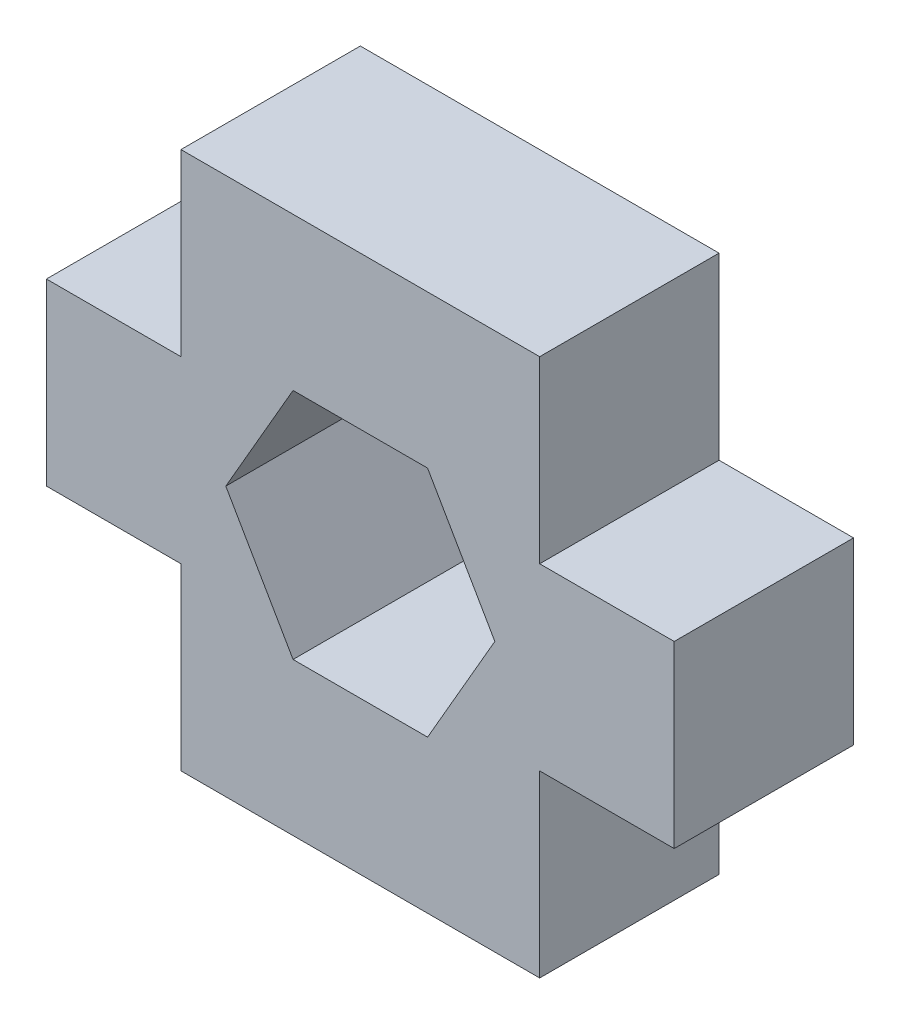
ISO-10303-21;
HEADER;
FILE_DESCRIPTION(('STEP AP214'),'2;1');
FILE_NAME('part.step','',(''),(''),'','','');
FILE_SCHEMA(('AUTOMOTIVE_DESIGN { 1 0 10303 214 1 1 1 1 }'));
ENDSEC;
DATA;
#1=APPLICATION_CONTEXT('core data for automotive mechanical design processes');
#2=APPLICATION_PROTOCOL_DEFINITION('international standard','automotive_design',2000,#1);
#3=PRODUCT_CONTEXT('',#1,'mechanical');
#4=PRODUCT('Part','Part','',(#3));
#5=PRODUCT_RELATED_PRODUCT_CATEGORY('part','',(#4));
#6=PRODUCT_DEFINITION_FORMATION('','',#4);
#7=PRODUCT_DEFINITION_CONTEXT('part definition',#1,'design');
#8=PRODUCT_DEFINITION('design','',#6,#7);
#9=PRODUCT_DEFINITION_SHAPE('','',#8);
#10=(LENGTH_UNIT() NAMED_UNIT(*) SI_UNIT(.MILLI.,.METRE.));
#11=(NAMED_UNIT(*) PLANE_ANGLE_UNIT() SI_UNIT($,.RADIAN.));
#12=(NAMED_UNIT(*) SI_UNIT($,.STERADIAN.) SOLID_ANGLE_UNIT());
#13=UNCERTAINTY_MEASURE_WITH_UNIT(LENGTH_MEASURE(1.E-05),#10,'distance_accuracy_value','');
#14=(GEOMETRIC_REPRESENTATION_CONTEXT(3) GLOBAL_UNCERTAINTY_ASSIGNED_CONTEXT((#13)) GLOBAL_UNIT_ASSIGNED_CONTEXT((#10,
#11,#12)) REPRESENTATION_CONTEXT('',''));
#15=CARTESIAN_POINT('',(0.,0.,0.));
#16=DIRECTION('',(0.,0.,1.));
#17=DIRECTION('',(1.,0.,0.));
#18=AXIS2_PLACEMENT_3D('',#15,#16,#17);
#19=CARTESIAN_POINT('',(0.,0.,4.));
#20=DIRECTION('',(0.,0.,1.));
#21=DIRECTION('',(1.,0.,0.));
#22=AXIS2_PLACEMENT_3D('',#19,#20,#21);
#23=PLANE('',#22);
#24=DIRECTION('',(0.,-1.,0.));
#25=VECTOR('',#24,1.);
#26=CARTESIAN_POINT('',(0.,4.,4.));
#27=LINE('',#26,#25);
#28=CARTESIAN_POINT('',(0.,4.,4.));
#29=VERTEX_POINT('',#28);
#30=CARTESIAN_POINT('',(0.,0.,4.));
#31=VERTEX_POINT('',#30);
#32=EDGE_CURVE('E211',#29,#31,#27,.T.);
#33=ORIENTED_EDGE('',*,*,#32,.T.);
#34=DIRECTION('',(1.,0.,0.));
#35=VECTOR('',#34,1.);
#36=CARTESIAN_POINT('',(0.,0.,4.));
#37=LINE('',#36,#35);
#38=CARTESIAN_POINT('',(8.,0.,4.));
#39=VERTEX_POINT('',#38);
#40=EDGE_CURVE('E214',#31,#39,#37,.T.);
#41=ORIENTED_EDGE('',*,*,#40,.T.);
#42=DIRECTION('',(0.,1.,0.));
#43=VECTOR('',#42,1.);
#44=CARTESIAN_POINT('',(8.,0.,4.));
#45=LINE('',#44,#43);
#46=CARTESIAN_POINT('',(8.,4.,4.));
#47=VERTEX_POINT('',#46);
#48=EDGE_CURVE('E217',#39,#47,#45,.T.);
#49=ORIENTED_EDGE('',*,*,#48,.T.);
#50=DIRECTION('',(1.,0.,0.));
#51=VECTOR('',#50,1.);
#52=CARTESIAN_POINT('',(8.,4.,4.));
#53=LINE('',#52,#51);
#54=CARTESIAN_POINT('',(11.,4.,4.));
#55=VERTEX_POINT('',#54);
#56=EDGE_CURVE('E219',#47,#55,#53,.T.);
#57=ORIENTED_EDGE('',*,*,#56,.T.);
#58=DIRECTION('',(0.,1.,0.));
#59=VECTOR('',#58,1.);
#60=CARTESIAN_POINT('',(11.,4.,4.));
#61=LINE('',#60,#59);
#62=CARTESIAN_POINT('',(11.,8.,4.));
#63=VERTEX_POINT('',#62);
#64=EDGE_CURVE('E221',#55,#63,#61,.T.);
#65=ORIENTED_EDGE('',*,*,#64,.T.);
#66=DIRECTION('',(-1.,0.,0.));
#67=VECTOR('',#66,1.);
#68=CARTESIAN_POINT('',(8.,8.,4.));
#69=LINE('',#68,#67);
#70=CARTESIAN_POINT('',(8.,8.,4.));
#71=VERTEX_POINT('',#70);
#72=EDGE_CURVE('E223',#63,#71,#69,.T.);
#73=ORIENTED_EDGE('',*,*,#72,.T.);
#74=DIRECTION('',(0.,1.,0.));
#75=VECTOR('',#74,1.);
#76=CARTESIAN_POINT('',(8.,8.,4.));
#77=LINE('',#76,#75);
#78=CARTESIAN_POINT('',(8.,12.,4.));
#79=VERTEX_POINT('',#78);
#80=EDGE_CURVE('E225',#71,#79,#77,.T.);
#81=ORIENTED_EDGE('',*,*,#80,.T.);
#82=DIRECTION('',(-1.,0.,0.));
#83=VECTOR('',#82,1.);
#84=CARTESIAN_POINT('',(8.,12.,4.));
#85=LINE('',#84,#83);
#86=CARTESIAN_POINT('',(0.,12.,4.));
#87=VERTEX_POINT('',#86);
#88=EDGE_CURVE('E227',#79,#87,#85,.T.);
#89=ORIENTED_EDGE('',*,*,#88,.T.);
#90=DIRECTION('',(0.,-1.,0.));
#91=VECTOR('',#90,1.);
#92=CARTESIAN_POINT('',(0.,12.,4.));
#93=LINE('',#92,#91);
#94=CARTESIAN_POINT('',(0.,8.,4.));
#95=VERTEX_POINT('',#94);
#96=EDGE_CURVE('E229',#87,#95,#93,.T.);
#97=ORIENTED_EDGE('',*,*,#96,.T.);
#98=DIRECTION('',(-1.,0.,0.));
#99=VECTOR('',#98,1.);
#100=CARTESIAN_POINT('',(0.,8.,4.));
#101=LINE('',#100,#99);
#102=CARTESIAN_POINT('',(-3.,8.,4.));
#103=VERTEX_POINT('',#102);
#104=EDGE_CURVE('E231',#95,#103,#101,.T.);
#105=ORIENTED_EDGE('',*,*,#104,.T.);
#106=DIRECTION('',(0.,-1.,0.));
#107=VECTOR('',#106,1.);
#108=CARTESIAN_POINT('',(-3.,8.,4.));
#109=LINE('',#108,#107);
#110=CARTESIAN_POINT('',(-3.,4.,4.));
#111=VERTEX_POINT('',#110);
#112=EDGE_CURVE('E233',#103,#111,#109,.T.);
#113=ORIENTED_EDGE('',*,*,#112,.T.);
#114=DIRECTION('',(1.,0.,0.));
#115=VECTOR('',#114,1.);
#116=CARTESIAN_POINT('',(-3.,4.,4.));
#117=LINE('',#116,#115);
#118=EDGE_CURVE('E235',#111,#29,#117,.T.);
#119=ORIENTED_EDGE('',*,*,#118,.T.);
#120=EDGE_LOOP('',(#33,#41,#49,#57,#65,#73,#81,#89,#97,#105,#113,#119));
#121=FACE_BOUND('',#120,.T.);
#122=DIRECTION('',(-0.5,0.866025403784439,0.));
#123=VECTOR('',#122,1.);
#124=CARTESIAN_POINT('',(7.00000000000003,5.99999999999998,4.));
#125=LINE('',#124,#123);
#126=CARTESIAN_POINT('',(7.00000000000003,5.99999999999998,4.));
#127=VERTEX_POINT('',#126);
#128=CARTESIAN_POINT('',(5.50000000000002,8.59807621135331,4.));
#129=VERTEX_POINT('',#128);
#130=EDGE_CURVE('E168',#127,#129,#125,.T.);
#131=ORIENTED_EDGE('',*,*,#130,.F.);
#132=DIRECTION('',(0.5,0.866025403784439,0.));
#133=VECTOR('',#132,1.);
#134=CARTESIAN_POINT('',(5.50000000000002,3.40192378864665,4.));
#135=LINE('',#134,#133);
#136=CARTESIAN_POINT('',(5.50000000000002,3.40192378864665,4.));
#137=VERTEX_POINT('',#136);
#138=EDGE_CURVE('E160',#137,#127,#135,.T.);
#139=ORIENTED_EDGE('',*,*,#138,.F.);
#140=DIRECTION('',(1.,0.,0.));
#141=VECTOR('',#140,1.);
#142=CARTESIAN_POINT('',(2.50000000000001,3.40192378864666,4.));
#143=LINE('',#142,#141);
#144=CARTESIAN_POINT('',(2.50000000000001,3.40192378864666,4.));
#145=VERTEX_POINT('',#144);
#146=EDGE_CURVE('E189',#145,#137,#143,.T.);
#147=ORIENTED_EDGE('',*,*,#146,.F.);
#148=DIRECTION('',(0.5,-0.866025403784438,0.));
#149=VECTOR('',#148,1.);
#150=CARTESIAN_POINT('',(1.,5.99999999999998,4.));
#151=LINE('',#150,#149);
#152=CARTESIAN_POINT('',(1.,5.99999999999998,4.));
#153=VERTEX_POINT('',#152);
#154=EDGE_CURVE('E187',#153,#145,#151,.T.);
#155=ORIENTED_EDGE('',*,*,#154,.F.);
#156=DIRECTION('',(-0.5,-0.866025403784439,0.));
#157=VECTOR('',#156,1.);
#158=CARTESIAN_POINT('',(2.50000000000001,8.59807621135331,4.));
#159=LINE('',#158,#157);
#160=CARTESIAN_POINT('',(2.50000000000001,8.59807621135331,4.));
#161=VERTEX_POINT('',#160);
#162=EDGE_CURVE('E183',#161,#153,#159,.T.);
#163=ORIENTED_EDGE('',*,*,#162,.F.);
#164=DIRECTION('',(-1.,0.,0.));
#165=VECTOR('',#164,1.);
#166=CARTESIAN_POINT('',(5.50000000000002,8.59807621135331,4.));
#167=LINE('',#166,#165);
#168=EDGE_CURVE('E181',#129,#161,#167,.T.);
#169=ORIENTED_EDGE('',*,*,#168,.F.);
#170=EDGE_LOOP('',(#131,#139,#147,#155,#163,#169));
#171=FACE_BOUND('',#170,.T.);
#172=ADVANCED_FACE('F35',(#121,#171),#23,.T.);
#173=CARTESIAN_POINT('',(0.,0.,0.));
#174=DIRECTION('',(0.,0.,1.));
#175=DIRECTION('',(1.,0.,0.));
#176=AXIS2_PLACEMENT_3D('',#173,#174,#175);
#177=PLANE('',#176);
#178=DIRECTION('',(0.,-1.,0.));
#179=VECTOR('',#178,1.);
#180=CARTESIAN_POINT('',(0.,4.,0.));
#181=LINE('',#180,#179);
#182=CARTESIAN_POINT('',(0.,4.,0.));
#183=VERTEX_POINT('',#182);
#184=CARTESIAN_POINT('',(0.,0.,0.));
#185=VERTEX_POINT('',#184);
#186=EDGE_CURVE('E176',#183,#185,#181,.T.);
#187=ORIENTED_EDGE('',*,*,#186,.F.);
#188=DIRECTION('',(1.,0.,0.));
#189=VECTOR('',#188,1.);
#190=CARTESIAN_POINT('',(-3.,4.,0.));
#191=LINE('',#190,#189);
#192=CARTESIAN_POINT('',(-3.,4.,0.));
#193=VERTEX_POINT('',#192);
#194=EDGE_CURVE('E215',#193,#183,#191,.T.);
#195=ORIENTED_EDGE('',*,*,#194,.F.);
#196=DIRECTION('',(0.,-1.,0.));
#197=VECTOR('',#196,1.);
#198=CARTESIAN_POINT('',(-3.,8.,0.));
#199=LINE('',#198,#197);
#200=CARTESIAN_POINT('',(-3.,8.,0.));
#201=VERTEX_POINT('',#200);
#202=EDGE_CURVE('E258',#201,#193,#199,.T.);
#203=ORIENTED_EDGE('',*,*,#202,.F.);
#204=DIRECTION('',(-1.,0.,0.));
#205=VECTOR('',#204,1.);
#206=CARTESIAN_POINT('',(0.,8.,0.));
#207=LINE('',#206,#205);
#208=CARTESIAN_POINT('',(0.,8.,0.));
#209=VERTEX_POINT('',#208);
#210=EDGE_CURVE('E256',#209,#201,#207,.T.);
#211=ORIENTED_EDGE('',*,*,#210,.F.);
#212=DIRECTION('',(0.,-1.,0.));
#213=VECTOR('',#212,1.);
#214=CARTESIAN_POINT('',(0.,12.,0.));
#215=LINE('',#214,#213);
#216=CARTESIAN_POINT('',(0.,12.,0.));
#217=VERTEX_POINT('',#216);
#218=EDGE_CURVE('E254',#217,#209,#215,.T.);
#219=ORIENTED_EDGE('',*,*,#218,.F.);
#220=DIRECTION('',(-1.,0.,0.));
#221=VECTOR('',#220,1.);
#222=CARTESIAN_POINT('',(8.,12.,0.));
#223=LINE('',#222,#221);
#224=CARTESIAN_POINT('',(8.,12.,0.));
#225=VERTEX_POINT('',#224);
#226=EDGE_CURVE('E252',#225,#217,#223,.T.);
#227=ORIENTED_EDGE('',*,*,#226,.F.);
#228=DIRECTION('',(0.,1.,0.));
#229=VECTOR('',#228,1.);
#230=CARTESIAN_POINT('',(8.,8.,0.));
#231=LINE('',#230,#229);
#232=CARTESIAN_POINT('',(8.,8.,0.));
#233=VERTEX_POINT('',#232);
#234=EDGE_CURVE('E250',#233,#225,#231,.T.);
#235=ORIENTED_EDGE('',*,*,#234,.F.);
#236=DIRECTION('',(-1.,0.,0.));
#237=VECTOR('',#236,1.);
#238=CARTESIAN_POINT('',(8.,8.,0.));
#239=LINE('',#238,#237);
#240=CARTESIAN_POINT('',(11.,8.,0.));
#241=VERTEX_POINT('',#240);
#242=EDGE_CURVE('E248',#241,#233,#239,.T.);
#243=ORIENTED_EDGE('',*,*,#242,.F.);
#244=DIRECTION('',(0.,1.,0.));
#245=VECTOR('',#244,1.);
#246=CARTESIAN_POINT('',(11.,4.,0.));
#247=LINE('',#246,#245);
#248=CARTESIAN_POINT('',(11.,4.,0.));
#249=VERTEX_POINT('',#248);
#250=EDGE_CURVE('E246',#249,#241,#247,.T.);
#251=ORIENTED_EDGE('',*,*,#250,.F.);
#252=DIRECTION('',(1.,0.,0.));
#253=VECTOR('',#252,1.);
#254=CARTESIAN_POINT('',(8.,4.,0.));
#255=LINE('',#254,#253);
#256=CARTESIAN_POINT('',(8.,4.,0.));
#257=VERTEX_POINT('',#256);
#258=EDGE_CURVE('E244',#257,#249,#255,.T.);
#259=ORIENTED_EDGE('',*,*,#258,.F.);
#260=DIRECTION('',(0.,1.,0.));
#261=VECTOR('',#260,1.);
#262=CARTESIAN_POINT('',(8.,0.,0.));
#263=LINE('',#262,#261);
#264=CARTESIAN_POINT('',(8.,0.,0.));
#265=VERTEX_POINT('',#264);
#266=EDGE_CURVE('E242',#265,#257,#263,.T.);
#267=ORIENTED_EDGE('',*,*,#266,.F.);
#268=DIRECTION('',(1.,0.,0.));
#269=VECTOR('',#268,1.);
#270=CARTESIAN_POINT('',(0.,0.,0.));
#271=LINE('',#270,#269);
#272=EDGE_CURVE('E240',#185,#265,#271,.T.);
#273=ORIENTED_EDGE('',*,*,#272,.F.);
#274=EDGE_LOOP('',(#187,#195,#203,#211,#219,#227,#235,#243,#251,#259,#267,#273));
#275=FACE_BOUND('',#274,.T.);
#276=DIRECTION('',(0.5,0.866025403784439,0.));
#277=VECTOR('',#276,1.);
#278=CARTESIAN_POINT('',(5.50000000000002,3.40192378864665,0.));
#279=LINE('',#278,#277);
#280=CARTESIAN_POINT('',(5.50000000000002,3.40192378864665,0.));
#281=VERTEX_POINT('',#280);
#282=CARTESIAN_POINT('',(7.00000000000003,5.99999999999998,0.));
#283=VERTEX_POINT('',#282);
#284=EDGE_CURVE('E58',#281,#283,#279,.T.);
#285=ORIENTED_EDGE('',*,*,#284,.T.);
#286=DIRECTION('',(-0.5,0.866025403784439,0.));
#287=VECTOR('',#286,1.);
#288=CARTESIAN_POINT('',(7.00000000000003,5.99999999999998,0.));
#289=LINE('',#288,#287);
#290=CARTESIAN_POINT('',(5.50000000000002,8.59807621135331,0.));
#291=VERTEX_POINT('',#290);
#292=EDGE_CURVE('E175',#283,#291,#289,.T.);
#293=ORIENTED_EDGE('',*,*,#292,.T.);
#294=DIRECTION('',(-1.,0.,0.));
#295=VECTOR('',#294,1.);
#296=CARTESIAN_POINT('',(5.50000000000002,8.59807621135331,0.));
#297=LINE('',#296,#295);
#298=CARTESIAN_POINT('',(2.50000000000001,8.59807621135331,0.));
#299=VERTEX_POINT('',#298);
#300=EDGE_CURVE('E193',#291,#299,#297,.T.);
#301=ORIENTED_EDGE('',*,*,#300,.T.);
#302=DIRECTION('',(-0.5,-0.866025403784439,0.));
#303=VECTOR('',#302,1.);
#304=CARTESIAN_POINT('',(2.50000000000001,8.59807621135331,0.));
#305=LINE('',#304,#303);
#306=CARTESIAN_POINT('',(1.,5.99999999999998,0.));
#307=VERTEX_POINT('',#306);
#308=EDGE_CURVE('E196',#299,#307,#305,.T.);
#309=ORIENTED_EDGE('',*,*,#308,.T.);
#310=DIRECTION('',(0.5,-0.866025403784438,0.));
#311=VECTOR('',#310,1.);
#312=CARTESIAN_POINT('',(1.,5.99999999999998,0.));
#313=LINE('',#312,#311);
#314=CARTESIAN_POINT('',(2.50000000000001,3.40192378864666,0.));
#315=VERTEX_POINT('',#314);
#316=EDGE_CURVE('E199',#307,#315,#313,.T.);
#317=ORIENTED_EDGE('',*,*,#316,.T.);
#318=DIRECTION('',(1.,0.,0.));
#319=VECTOR('',#318,1.);
#320=CARTESIAN_POINT('',(2.50000000000001,3.40192378864666,0.));
#321=LINE('',#320,#319);
#322=EDGE_CURVE('E169',#315,#281,#321,.T.);
#323=ORIENTED_EDGE('',*,*,#322,.T.);
#324=EDGE_LOOP('',(#285,#293,#301,#309,#317,#323));
#325=FACE_BOUND('',#324,.T.);
#326=ADVANCED_FACE('F300',(#275,#325),#177,.F.);
#327=CARTESIAN_POINT('',(0.,4.,4.));
#328=DIRECTION('',(1.,0.,0.));
#329=DIRECTION('',(0.,0.,-1.));
#330=AXIS2_PLACEMENT_3D('',#327,#328,#329);
#331=PLANE('',#330);
#332=ORIENTED_EDGE('',*,*,#186,.T.);
#333=DIRECTION('',(0.,0.,-1.));
#334=VECTOR('',#333,1.);
#335=CARTESIAN_POINT('',(0.,0.,4.));
#336=LINE('',#335,#334);
#337=EDGE_CURVE('E11',#31,#185,#336,.T.);
#338=ORIENTED_EDGE('',*,*,#337,.F.);
#339=ORIENTED_EDGE('',*,*,#32,.F.);
#340=DIRECTION('',(0.,0.,-1.));
#341=VECTOR('',#340,1.);
#342=CARTESIAN_POINT('',(0.,4.,4.));
#343=LINE('',#342,#341);
#344=EDGE_CURVE('E237',#29,#183,#343,.T.);
#345=ORIENTED_EDGE('',*,*,#344,.T.);
#346=EDGE_LOOP('',(#332,#338,#339,#345));
#347=FACE_BOUND('',#346,.T.);
#348=ADVANCED_FACE('F37',(#347),#331,.F.);
#349=CARTESIAN_POINT('',(0.,0.,4.));
#350=DIRECTION('',(0.,1.,0.));
#351=DIRECTION('',(0.,0.,1.));
#352=AXIS2_PLACEMENT_3D('',#349,#350,#351);
#353=PLANE('',#352);
#354=ORIENTED_EDGE('',*,*,#272,.T.);
#355=DIRECTION('',(0.,0.,-1.));
#356=VECTOR('',#355,1.);
#357=CARTESIAN_POINT('',(8.,0.,4.));
#358=LINE('',#357,#356);
#359=EDGE_CURVE('E43',#39,#265,#358,.T.);
#360=ORIENTED_EDGE('',*,*,#359,.F.);
#361=ORIENTED_EDGE('',*,*,#40,.F.);
#362=ORIENTED_EDGE('',*,*,#337,.T.);
#363=EDGE_LOOP('',(#354,#360,#361,#362));
#364=FACE_BOUND('',#363,.T.);
#365=ADVANCED_FACE('F317',(#364),#353,.F.);
#366=CARTESIAN_POINT('',(8.,0.,4.));
#367=DIRECTION('',(-1.,0.,0.));
#368=DIRECTION('',(0.,0.,1.));
#369=AXIS2_PLACEMENT_3D('',#366,#367,#368);
#370=PLANE('',#369);
#371=ORIENTED_EDGE('',*,*,#266,.T.);
#372=DIRECTION('',(0.,0.,-1.));
#373=VECTOR('',#372,1.);
#374=CARTESIAN_POINT('',(8.,4.,4.));
#375=LINE('',#374,#373);
#376=EDGE_CURVE('E287',#47,#257,#375,.T.);
#377=ORIENTED_EDGE('',*,*,#376,.F.);
#378=ORIENTED_EDGE('',*,*,#48,.F.);
#379=ORIENTED_EDGE('',*,*,#359,.T.);
#380=EDGE_LOOP('',(#371,#377,#378,#379));
#381=FACE_BOUND('',#380,.T.);
#382=ADVANCED_FACE('F294',(#381),#370,.F.);
#383=CARTESIAN_POINT('',(8.,4.,4.));
#384=DIRECTION('',(0.,1.,0.));
#385=DIRECTION('',(-1.,0.,0.));
#386=AXIS2_PLACEMENT_3D('',#383,#384,#385);
#387=PLANE('',#386);
#388=ORIENTED_EDGE('',*,*,#258,.T.);
#389=DIRECTION('',(0.,0.,-1.));
#390=VECTOR('',#389,1.);
#391=CARTESIAN_POINT('',(11.,4.,4.));
#392=LINE('',#391,#390);
#393=EDGE_CURVE('E284',#55,#249,#392,.T.);
#394=ORIENTED_EDGE('',*,*,#393,.F.);
#395=ORIENTED_EDGE('',*,*,#56,.F.);
#396=ORIENTED_EDGE('',*,*,#376,.T.);
#397=EDGE_LOOP('',(#388,#394,#395,#396));
#398=FACE_BOUND('',#397,.T.);
#399=ADVANCED_FACE('F306',(#398),#387,.F.);
#400=CARTESIAN_POINT('',(11.,4.,4.));
#401=DIRECTION('',(-1.,0.,0.));
#402=DIRECTION('',(0.,0.,1.));
#403=AXIS2_PLACEMENT_3D('',#400,#401,#402);
#404=PLANE('',#403);
#405=ORIENTED_EDGE('',*,*,#250,.T.);
#406=DIRECTION('',(0.,0.,-1.));
#407=VECTOR('',#406,1.);
#408=CARTESIAN_POINT('',(11.,8.,4.));
#409=LINE('',#408,#407);
#410=EDGE_CURVE('E281',#63,#241,#409,.T.);
#411=ORIENTED_EDGE('',*,*,#410,.F.);
#412=ORIENTED_EDGE('',*,*,#64,.F.);
#413=ORIENTED_EDGE('',*,*,#393,.T.);
#414=EDGE_LOOP('',(#405,#411,#412,#413));
#415=FACE_BOUND('',#414,.T.);
#416=ADVANCED_FACE('F310',(#415),#404,.F.);
#417=CARTESIAN_POINT('',(8.,8.,4.));
#418=DIRECTION('',(0.,-1.,0.));
#419=DIRECTION('',(0.,0.,-1.));
#420=AXIS2_PLACEMENT_3D('',#417,#418,#419);
#421=PLANE('',#420);
#422=ORIENTED_EDGE('',*,*,#242,.T.);
#423=DIRECTION('',(0.,0.,-1.));
#424=VECTOR('',#423,1.);
#425=CARTESIAN_POINT('',(8.,8.,4.));
#426=LINE('',#425,#424);
#427=EDGE_CURVE('E278',#71,#233,#426,.T.);
#428=ORIENTED_EDGE('',*,*,#427,.F.);
#429=ORIENTED_EDGE('',*,*,#72,.F.);
#430=ORIENTED_EDGE('',*,*,#410,.T.);
#431=EDGE_LOOP('',(#422,#428,#429,#430));
#432=FACE_BOUND('',#431,.T.);
#433=ADVANCED_FACE('F350',(#432),#421,.F.);
#434=CARTESIAN_POINT('',(8.,8.,4.));
#435=DIRECTION('',(-1.,0.,0.));
#436=DIRECTION('',(0.,0.,1.));
#437=AXIS2_PLACEMENT_3D('',#434,#435,#436);
#438=PLANE('',#437);
#439=ORIENTED_EDGE('',*,*,#234,.T.);
#440=DIRECTION('',(0.,0.,-1.));
#441=VECTOR('',#440,1.);
#442=CARTESIAN_POINT('',(8.,12.,4.));
#443=LINE('',#442,#441);
#444=EDGE_CURVE('E275',#79,#225,#443,.T.);
#445=ORIENTED_EDGE('',*,*,#444,.F.);
#446=ORIENTED_EDGE('',*,*,#80,.F.);
#447=ORIENTED_EDGE('',*,*,#427,.T.);
#448=EDGE_LOOP('',(#439,#445,#446,#447));
#449=FACE_BOUND('',#448,.T.);
#450=ADVANCED_FACE('F348',(#449),#438,.F.);
#451=CARTESIAN_POINT('',(8.,12.,4.));
#452=DIRECTION('',(0.,-1.,0.));
#453=DIRECTION('',(0.,0.,-1.));
#454=AXIS2_PLACEMENT_3D('',#451,#452,#453);
#455=PLANE('',#454);
#456=ORIENTED_EDGE('',*,*,#226,.T.);
#457=DIRECTION('',(0.,0.,-1.));
#458=VECTOR('',#457,1.);
#459=CARTESIAN_POINT('',(0.,12.,4.));
#460=LINE('',#459,#458);
#461=EDGE_CURVE('E272',#87,#217,#460,.T.);
#462=ORIENTED_EDGE('',*,*,#461,.F.);
#463=ORIENTED_EDGE('',*,*,#88,.F.);
#464=ORIENTED_EDGE('',*,*,#444,.T.);
#465=EDGE_LOOP('',(#456,#462,#463,#464));
#466=FACE_BOUND('',#465,.T.);
#467=ADVANCED_FACE('F344',(#466),#455,.F.);
#468=CARTESIAN_POINT('',(0.,12.,4.));
#469=DIRECTION('',(1.,0.,0.));
#470=DIRECTION('',(0.,0.,-1.));
#471=AXIS2_PLACEMENT_3D('',#468,#469,#470);
#472=PLANE('',#471);
#473=ORIENTED_EDGE('',*,*,#218,.T.);
#474=DIRECTION('',(0.,0.,-1.));
#475=VECTOR('',#474,1.);
#476=CARTESIAN_POINT('',(0.,8.,4.));
#477=LINE('',#476,#475);
#478=EDGE_CURVE('E269',#95,#209,#477,.T.);
#479=ORIENTED_EDGE('',*,*,#478,.F.);
#480=ORIENTED_EDGE('',*,*,#96,.F.);
#481=ORIENTED_EDGE('',*,*,#461,.T.);
#482=EDGE_LOOP('',(#473,#479,#480,#481));
#483=FACE_BOUND('',#482,.T.);
#484=ADVANCED_FACE('F339',(#483),#472,.F.);
#485=CARTESIAN_POINT('',(0.,8.,4.));
#486=DIRECTION('',(0.,-1.,0.));
#487=DIRECTION('',(0.,0.,-1.));
#488=AXIS2_PLACEMENT_3D('',#485,#486,#487);
#489=PLANE('',#488);
#490=ORIENTED_EDGE('',*,*,#210,.T.);
#491=DIRECTION('',(0.,0.,-1.));
#492=VECTOR('',#491,1.);
#493=CARTESIAN_POINT('',(-3.,8.,4.));
#494=LINE('',#493,#492);
#495=EDGE_CURVE('E266',#103,#201,#494,.T.);
#496=ORIENTED_EDGE('',*,*,#495,.F.);
#497=ORIENTED_EDGE('',*,*,#104,.F.);
#498=ORIENTED_EDGE('',*,*,#478,.T.);
#499=EDGE_LOOP('',(#490,#496,#497,#498));
#500=FACE_BOUND('',#499,.T.);
#501=ADVANCED_FACE('F333',(#500),#489,.F.);
#502=CARTESIAN_POINT('',(-3.,8.,4.));
#503=DIRECTION('',(1.,0.,0.));
#504=DIRECTION('',(0.,0.,-1.));
#505=AXIS2_PLACEMENT_3D('',#502,#503,#504);
#506=PLANE('',#505);
#507=ORIENTED_EDGE('',*,*,#202,.T.);
#508=DIRECTION('',(0.,0.,-1.));
#509=VECTOR('',#508,1.);
#510=CARTESIAN_POINT('',(-3.,4.,4.));
#511=LINE('',#510,#509);
#512=EDGE_CURVE('E263',#111,#193,#511,.T.);
#513=ORIENTED_EDGE('',*,*,#512,.F.);
#514=ORIENTED_EDGE('',*,*,#112,.F.);
#515=ORIENTED_EDGE('',*,*,#495,.T.);
#516=EDGE_LOOP('',(#507,#513,#514,#515));
#517=FACE_BOUND('',#516,.T.);
#518=ADVANCED_FACE('F329',(#517),#506,.F.);
#519=CARTESIAN_POINT('',(-3.,4.,4.));
#520=DIRECTION('',(0.,1.,0.));
#521=DIRECTION('',(0.,0.,1.));
#522=AXIS2_PLACEMENT_3D('',#519,#520,#521);
#523=PLANE('',#522);
#524=ORIENTED_EDGE('',*,*,#194,.T.);
#525=ORIENTED_EDGE('',*,*,#344,.F.);
#526=ORIENTED_EDGE('',*,*,#118,.F.);
#527=ORIENTED_EDGE('',*,*,#512,.T.);
#528=EDGE_LOOP('',(#524,#525,#526,#527));
#529=FACE_BOUND('',#528,.T.);
#530=ADVANCED_FACE('F324',(#529),#523,.F.);
#531=CARTESIAN_POINT('',(5.50000000000002,3.40192378864665,4.));
#532=DIRECTION('',(-0.866025403784439,0.5,0.));
#533=DIRECTION('',(-0.5,-0.866025403784439,0.));
#534=AXIS2_PLACEMENT_3D('',#531,#532,#533);
#535=PLANE('',#534);
#536=ORIENTED_EDGE('',*,*,#284,.F.);
#537=DIRECTION('',(0.,0.,-1.));
#538=VECTOR('',#537,1.);
#539=CARTESIAN_POINT('',(5.50000000000002,3.40192378864665,4.));
#540=LINE('',#539,#538);
#541=EDGE_CURVE('E164',#137,#281,#540,.T.);
#542=ORIENTED_EDGE('',*,*,#541,.F.);
#543=ORIENTED_EDGE('',*,*,#138,.T.);
#544=DIRECTION('',(0.,0.,-1.));
#545=VECTOR('',#544,1.);
#546=CARTESIAN_POINT('',(7.00000000000003,5.99999999999998,4.));
#547=LINE('',#546,#545);
#548=EDGE_CURVE('E163',#127,#283,#547,.T.);
#549=ORIENTED_EDGE('',*,*,#548,.T.);
#550=EDGE_LOOP('',(#536,#542,#543,#549));
#551=FACE_BOUND('',#550,.T.);
#552=ADVANCED_FACE('F162',(#551),#535,.T.);
#553=CARTESIAN_POINT('',(7.00000000000003,5.99999999999998,4.));
#554=DIRECTION('',(-0.866025403784439,-0.5,0.));
#555=DIRECTION('',(0.5,-0.866025403784439,0.));
#556=AXIS2_PLACEMENT_3D('',#553,#554,#555);
#557=PLANE('',#556);
#558=ORIENTED_EDGE('',*,*,#292,.F.);
#559=ORIENTED_EDGE('',*,*,#548,.F.);
#560=ORIENTED_EDGE('',*,*,#130,.T.);
#561=DIRECTION('',(0.,0.,-1.));
#562=VECTOR('',#561,1.);
#563=CARTESIAN_POINT('',(5.50000000000002,8.59807621135331,4.));
#564=LINE('',#563,#562);
#565=EDGE_CURVE('E177',#129,#291,#564,.T.);
#566=ORIENTED_EDGE('',*,*,#565,.T.);
#567=EDGE_LOOP('',(#558,#559,#560,#566));
#568=FACE_BOUND('',#567,.T.);
#569=ADVANCED_FACE('F172',(#568),#557,.T.);
#570=CARTESIAN_POINT('',(5.50000000000002,8.59807621135331,4.));
#571=DIRECTION('',(0.,-1.,0.));
#572=DIRECTION('',(1.,0.,0.));
#573=AXIS2_PLACEMENT_3D('',#570,#571,#572);
#574=PLANE('',#573);
#575=ORIENTED_EDGE('',*,*,#300,.F.);
#576=ORIENTED_EDGE('',*,*,#565,.F.);
#577=ORIENTED_EDGE('',*,*,#168,.T.);
#578=DIRECTION('',(0.,0.,-1.));
#579=VECTOR('',#578,1.);
#580=CARTESIAN_POINT('',(2.50000000000001,8.59807621135331,4.));
#581=LINE('',#580,#579);
#582=EDGE_CURVE('E208',#161,#299,#581,.T.);
#583=ORIENTED_EDGE('',*,*,#582,.T.);
#584=EDGE_LOOP('',(#575,#576,#577,#583));
#585=FACE_BOUND('',#584,.T.);
#586=ADVANCED_FACE('F408',(#585),#574,.T.);
#587=CARTESIAN_POINT('',(2.50000000000001,8.59807621135331,4.));
#588=DIRECTION('',(0.866025403784439,-0.5,0.));
#589=DIRECTION('',(0.5,0.866025403784439,0.));
#590=AXIS2_PLACEMENT_3D('',#587,#588,#589);
#591=PLANE('',#590);
#592=ORIENTED_EDGE('',*,*,#308,.F.);
#593=ORIENTED_EDGE('',*,*,#582,.F.);
#594=ORIENTED_EDGE('',*,*,#162,.T.);
#595=DIRECTION('',(0.,0.,-1.));
#596=VECTOR('',#595,1.);
#597=CARTESIAN_POINT('',(1.,5.99999999999998,4.));
#598=LINE('',#597,#596);
#599=EDGE_CURVE('E206',#153,#307,#598,.T.);
#600=ORIENTED_EDGE('',*,*,#599,.T.);
#601=EDGE_LOOP('',(#592,#593,#594,#600));
#602=FACE_BOUND('',#601,.T.);
#603=ADVANCED_FACE('F414',(#602),#591,.T.);
#604=CARTESIAN_POINT('',(1.,5.99999999999998,4.));
#605=DIRECTION('',(0.866025403784438,0.5,0.));
#606=DIRECTION('',(-0.5,0.866025403784439,0.));
#607=AXIS2_PLACEMENT_3D('',#604,#605,#606);
#608=PLANE('',#607);
#609=ORIENTED_EDGE('',*,*,#316,.F.);
#610=ORIENTED_EDGE('',*,*,#599,.F.);
#611=ORIENTED_EDGE('',*,*,#154,.T.);
#612=DIRECTION('',(0.,0.,-1.));
#613=VECTOR('',#612,1.);
#614=CARTESIAN_POINT('',(2.50000000000001,3.40192378864666,4.));
#615=LINE('',#614,#613);
#616=EDGE_CURVE('E50',#145,#315,#615,.T.);
#617=ORIENTED_EDGE('',*,*,#616,.T.);
#618=EDGE_LOOP('',(#609,#610,#611,#617));
#619=FACE_BOUND('',#618,.T.);
#620=ADVANCED_FACE('F422',(#619),#608,.T.);
#621=CARTESIAN_POINT('',(2.50000000000001,3.40192378864666,4.));
#622=DIRECTION('',(0.,1.,0.));
#623=DIRECTION('',(-1.,0.,0.));
#624=AXIS2_PLACEMENT_3D('',#621,#622,#623);
#625=PLANE('',#624);
#626=ORIENTED_EDGE('',*,*,#322,.F.);
#627=ORIENTED_EDGE('',*,*,#616,.F.);
#628=ORIENTED_EDGE('',*,*,#146,.T.);
#629=ORIENTED_EDGE('',*,*,#541,.T.);
#630=EDGE_LOOP('',(#626,#627,#628,#629));
#631=FACE_BOUND('',#630,.T.);
#632=ADVANCED_FACE('F430',(#631),#625,.T.);
#633=CLOSED_SHELL('',(#172,#326,#348,#365,#382,#399,#416,#433,#450,#467,#484,#501,#518,#530,
#552,#569,#586,#603,#620,#632));
#634=MANIFOLD_SOLID_BREP('B2',#633);
#635=ADVANCED_BREP_SHAPE_REPRESENTATION('',(#18,#634),#14);
#636=SHAPE_DEFINITION_REPRESENTATION(#9,#635);
ENDSEC;
END-ISO-10303-21;
